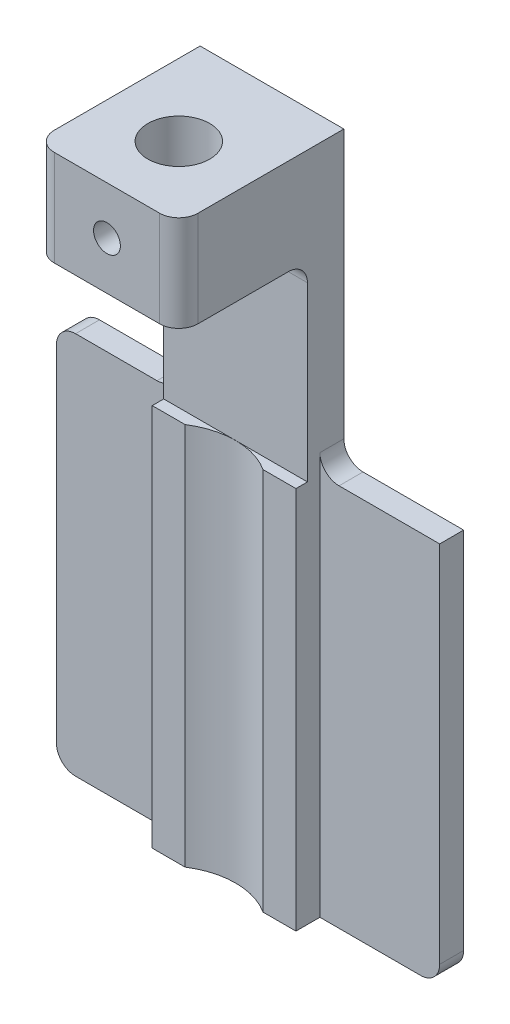
ISO-10303-21;
HEADER;
FILE_DESCRIPTION(('STEP AP214'),'2;1');
FILE_NAME('part.step','',(''),(''),'','','');
FILE_SCHEMA(('AUTOMOTIVE_DESIGN { 1 0 10303 214 1 1 1 1 }'));
ENDSEC;
DATA;
#1=APPLICATION_CONTEXT('core data for automotive mechanical design processes');
#2=APPLICATION_PROTOCOL_DEFINITION('international standard','automotive_design',2000,#1);
#3=PRODUCT_CONTEXT('',#1,'mechanical');
#4=PRODUCT('Part','Part','',(#3));
#5=PRODUCT_RELATED_PRODUCT_CATEGORY('part','',(#4));
#6=PRODUCT_DEFINITION_FORMATION('','',#4);
#7=PRODUCT_DEFINITION_CONTEXT('part definition',#1,'design');
#8=PRODUCT_DEFINITION('design','',#6,#7);
#9=PRODUCT_DEFINITION_SHAPE('','',#8);
#10=(LENGTH_UNIT() NAMED_UNIT(*) SI_UNIT(.MILLI.,.METRE.));
#11=(NAMED_UNIT(*) PLANE_ANGLE_UNIT() SI_UNIT($,.RADIAN.));
#12=(NAMED_UNIT(*) SI_UNIT($,.STERADIAN.) SOLID_ANGLE_UNIT());
#13=UNCERTAINTY_MEASURE_WITH_UNIT(LENGTH_MEASURE(1.E-05),#10,'distance_accuracy_value','');
#14=(GEOMETRIC_REPRESENTATION_CONTEXT(3) GLOBAL_UNCERTAINTY_ASSIGNED_CONTEXT((#13)) GLOBAL_UNIT_ASSIGNED_CONTEXT((#10,
#11,#12)) REPRESENTATION_CONTEXT('',''));
#15=CARTESIAN_POINT('',(0.,0.,0.));
#16=DIRECTION('',(0.,0.,1.));
#17=DIRECTION('',(1.,0.,0.));
#18=AXIS2_PLACEMENT_3D('',#15,#16,#17);
#19=CARTESIAN_POINT('',(4.7625,12.7,-3.));
#20=DIRECTION('',(0.,0.,-1.));
#21=DIRECTION('',(0.,1.,0.));
#22=AXIS2_PLACEMENT_3D('',#19,#20,#21);
#23=PLANE('',#22);
#24=DIRECTION('',(0.,-1.,0.));
#25=VECTOR('',#24,1.);
#26=CARTESIAN_POINT('',(4.7625,12.7,-3.));
#27=LINE('',#26,#25);
#28=CARTESIAN_POINT('',(4.7625,0.,-3.));
#29=VERTEX_POINT('',#28);
#30=CARTESIAN_POINT('',(4.7625,-25.4,-3.));
#31=VERTEX_POINT('',#30);
#32=EDGE_CURVE('E395',#29,#31,#27,.T.);
#33=ORIENTED_EDGE('',*,*,#32,.F.);
#34=DIRECTION('',(1.,0.,0.));
#35=VECTOR('',#34,1.);
#36=CARTESIAN_POINT('',(-8.72906081207247,0.,-3.));
#37=LINE('',#36,#35);
#38=CARTESIAN_POINT('',(2.58406772357072,0.,-3.));
#39=VERTEX_POINT('',#38);
#40=EDGE_CURVE('E220',#39,#29,#37,.T.);
#41=ORIENTED_EDGE('',*,*,#40,.F.);
#42=DIRECTION('',(0.,-1.,0.));
#43=VECTOR('',#42,1.);
#44=CARTESIAN_POINT('',(2.58406772357073,26.1703841816037,-3.));
#45=LINE('',#44,#43);
#46=CARTESIAN_POINT('',(2.58406772357072,-25.4,-3.));
#47=VERTEX_POINT('',#46);
#48=EDGE_CURVE('E387',#39,#47,#45,.T.);
#49=ORIENTED_EDGE('',*,*,#48,.T.);
#50=DIRECTION('',(-1.,0.,0.));
#51=VECTOR('',#50,1.);
#52=CARTESIAN_POINT('',(4.7625,-25.4,-3.));
#53=LINE('',#52,#51);
#54=EDGE_CURVE('E253',#31,#47,#53,.T.);
#55=ORIENTED_EDGE('',*,*,#54,.F.);
#56=EDGE_LOOP('',(#33,#41,#49,#55));
#57=FACE_BOUND('',#56,.T.);
#58=ADVANCED_FACE('F35',(#57),#23,.F.);
#59=CARTESIAN_POINT('',(4.7625,19.05,4.7625));
#60=DIRECTION('',(0.,0.,-1.));
#61=DIRECTION('',(-1.,0.,0.));
#62=AXIS2_PLACEMENT_3D('',#59,#60,#61);
#63=PLANE('',#62);
#64=CARTESIAN_POINT('',(0.,15.875,4.7625));
#65=DIRECTION('',(0.,0.,1.));
#66=DIRECTION('',(1.,0.,0.));
#67=AXIS2_PLACEMENT_3D('',#64,#65,#66);
#68=CIRCLE('',#67,0.889);
#69=CARTESIAN_POINT('',(0.889,15.875,4.7625));
#70=VERTEX_POINT('',#69);
#71=EDGE_CURVE('E476',#70,#70,#68,.T.);
#72=ORIENTED_EDGE('',*,*,#71,.F.);
#73=EDGE_LOOP('',(#72));
#74=FACE_BOUND('',#73,.T.);
#75=DIRECTION('',(-1.,0.,0.));
#76=VECTOR('',#75,1.);
#77=CARTESIAN_POINT('',(4.7625,19.05,4.7625));
#78=LINE('',#77,#76);
#79=CARTESIAN_POINT('',(3.4925,19.05,4.7625));
#80=VERTEX_POINT('',#79);
#81=CARTESIAN_POINT('',(-3.4925,19.05,4.7625));
#82=VERTEX_POINT('',#81);
#83=EDGE_CURVE('E242',#80,#82,#78,.T.);
#84=ORIENTED_EDGE('',*,*,#83,.T.);
#85=DIRECTION('',(0.,-1.,0.));
#86=VECTOR('',#85,1.);
#87=CARTESIAN_POINT('',(-3.4925,19.05,4.7625));
#88=LINE('',#87,#86);
#89=CARTESIAN_POINT('',(-3.4925,12.7,4.7625));
#90=VERTEX_POINT('',#89);
#91=EDGE_CURVE('E267',#82,#90,#88,.T.);
#92=ORIENTED_EDGE('',*,*,#91,.T.);
#93=DIRECTION('',(-1.,0.,0.));
#94=VECTOR('',#93,1.);
#95=CARTESIAN_POINT('',(4.7625,12.7,4.7625));
#96=LINE('',#95,#94);
#97=CARTESIAN_POINT('',(3.4925,12.7,4.7625));
#98=VERTEX_POINT('',#97);
#99=EDGE_CURVE('E256',#98,#90,#96,.T.);
#100=ORIENTED_EDGE('',*,*,#99,.F.);
#101=DIRECTION('',(0.,-1.,0.));
#102=VECTOR('',#101,1.);
#103=CARTESIAN_POINT('',(3.4925,19.05,4.7625));
#104=LINE('',#103,#102);
#105=EDGE_CURVE('E265',#98,#80,#104,.F.);
#106=ORIENTED_EDGE('',*,*,#105,.T.);
#107=EDGE_LOOP('',(#84,#92,#100,#106));
#108=FACE_BOUND('',#107,.T.);
#109=ADVANCED_FACE('F412',(#74,#108),#63,.F.);
#110=CARTESIAN_POINT('',(4.7625,12.7,4.7625));
#111=DIRECTION('',(0.,1.,0.));
#112=DIRECTION('',(0.,0.,1.));
#113=AXIS2_PLACEMENT_3D('',#110,#111,#112);
#114=PLANE('',#113);
#115=ORIENTED_EDGE('',*,*,#99,.T.);
#116=CARTESIAN_POINT('',(-3.4925,12.7,3.4925));
#117=DIRECTION('',(0.,1.,0.));
#118=DIRECTION('',(0.,0.,1.));
#119=AXIS2_PLACEMENT_3D('',#116,#117,#118);
#120=CIRCLE('',#119,1.27);
#121=CARTESIAN_POINT('',(-4.7625,12.7,3.4925));
#122=VERTEX_POINT('',#121);
#123=EDGE_CURVE('E274',#90,#122,#120,.F.);
#124=ORIENTED_EDGE('',*,*,#123,.T.);
#125=DIRECTION('',(0.,0.,-1.));
#126=VECTOR('',#125,1.);
#127=CARTESIAN_POINT('',(-4.7625,12.7,4.7625));
#128=LINE('',#127,#126);
#129=CARTESIAN_POINT('',(-4.7625,12.7,-2.492));
#130=VERTEX_POINT('',#129);
#131=EDGE_CURVE('E228',#122,#130,#128,.T.);
#132=ORIENTED_EDGE('',*,*,#131,.T.);
#133=DIRECTION('',(-1.,0.,0.));
#134=VECTOR('',#133,1.);
#135=CARTESIAN_POINT('',(4.7625,12.7,-2.492));
#136=LINE('',#135,#134);
#137=CARTESIAN_POINT('',(4.7625,12.7,-2.492));
#138=VERTEX_POINT('',#137);
#139=EDGE_CURVE('E270',#130,#138,#136,.F.);
#140=ORIENTED_EDGE('',*,*,#139,.T.);
#141=DIRECTION('',(0.,0.,-1.));
#142=VECTOR('',#141,1.);
#143=CARTESIAN_POINT('',(4.7625,12.7,4.7625));
#144=LINE('',#143,#142);
#145=CARTESIAN_POINT('',(4.7625,12.7,3.4925));
#146=VERTEX_POINT('',#145);
#147=EDGE_CURVE('E241',#146,#138,#144,.T.);
#148=ORIENTED_EDGE('',*,*,#147,.F.);
#149=CARTESIAN_POINT('',(3.4925,12.7,3.4925));
#150=DIRECTION('',(0.,1.,0.));
#151=DIRECTION('',(0.,0.,1.));
#152=AXIS2_PLACEMENT_3D('',#149,#150,#151);
#153=CIRCLE('',#152,1.27);
#154=EDGE_CURVE('E272',#146,#98,#153,.F.);
#155=ORIENTED_EDGE('',*,*,#154,.T.);
#156=EDGE_LOOP('',(#115,#124,#132,#140,#148,#155));
#157=FACE_BOUND('',#156,.T.);
#158=CARTESIAN_POINT('',(0.,12.7,0.));
#159=DIRECTION('',(0.,1.,0.));
#160=DIRECTION('',(0.,0.,1.));
#161=AXIS2_PLACEMENT_3D('',#158,#159,#160);
#162=CIRCLE('',#161,2.05);
#163=CARTESIAN_POINT('',(0.,12.7,2.05000000000001));
#164=VERTEX_POINT('',#163);
#165=EDGE_CURVE('E233',#164,#164,#162,.T.);
#166=ORIENTED_EDGE('',*,*,#165,.T.);
#167=EDGE_LOOP('',(#166));
#168=FACE_BOUND('',#167,.T.);
#169=ADVANCED_FACE('F337',(#157,#168),#114,.F.);
#170=DIRECTION('',(0.,-1.,0.));
#171=VECTOR('',#170,1.);
#172=CARTESIAN_POINT('',(-2.58406772357073,26.1703841816037,-3.));
#173=LINE('',#172,#171);
#174=CARTESIAN_POINT('',(-2.58406772357072,-25.4,-3.));
#175=VERTEX_POINT('',#174);
#176=CARTESIAN_POINT('',(-2.58406772357072,0.,-3.));
#177=VERTEX_POINT('',#176);
#178=EDGE_CURVE('E218',#175,#177,#173,.F.);
#179=ORIENTED_EDGE('',*,*,#178,.T.);
#180=CARTESIAN_POINT('',(-4.7625,0.,-3.));
#181=VERTEX_POINT('',#180);
#182=EDGE_CURVE('E203',#181,#177,#37,.T.);
#183=ORIENTED_EDGE('',*,*,#182,.F.);
#184=DIRECTION('',(0.,-1.,0.));
#185=VECTOR('',#184,1.);
#186=CARTESIAN_POINT('',(-4.7625,12.7,-3.));
#187=LINE('',#186,#185);
#188=CARTESIAN_POINT('',(-4.7625,-25.4,-3.));
#189=VERTEX_POINT('',#188);
#190=EDGE_CURVE('E216',#181,#189,#187,.T.);
#191=ORIENTED_EDGE('',*,*,#190,.T.);
#192=EDGE_CURVE('E252',#175,#189,#53,.T.);
#193=ORIENTED_EDGE('',*,*,#192,.F.);
#194=EDGE_LOOP('',(#179,#183,#191,#193));
#195=FACE_BOUND('',#194,.T.);
#196=ADVANCED_FACE('F214',(#195),#23,.F.);
#197=CARTESIAN_POINT('',(4.7625,-25.4,-3.));
#198=DIRECTION('',(0.,1.,0.));
#199=DIRECTION('',(0.,0.,1.));
#200=AXIS2_PLACEMENT_3D('',#197,#198,#199);
#201=PLANE('',#200);
#202=DIRECTION('',(-1.,0.,0.));
#203=VECTOR('',#202,1.);
#204=CARTESIAN_POINT('',(4.7625,-25.4,-6.175));
#205=LINE('',#204,#203);
#206=CARTESIAN_POINT('',(11.43,-25.4,-6.175));
#207=VERTEX_POINT('',#206);
#208=CARTESIAN_POINT('',(-11.43,-25.4,-6.175));
#209=VERTEX_POINT('',#208);
#210=EDGE_CURVE('E249',#207,#209,#205,.T.);
#211=ORIENTED_EDGE('',*,*,#210,.F.);
#212=DIRECTION('',(0.,0.,-1.));
#213=VECTOR('',#212,1.);
#214=CARTESIAN_POINT('',(11.43,-25.4,-4.5875));
#215=LINE('',#214,#213);
#216=CARTESIAN_POINT('',(11.43,-25.4,-4.5875));
#217=VERTEX_POINT('',#216);
#218=EDGE_CURVE('E302',#207,#217,#215,.F.);
#219=ORIENTED_EDGE('',*,*,#218,.T.);
#220=DIRECTION('',(-1.,0.,0.));
#221=VECTOR('',#220,1.);
#222=CARTESIAN_POINT('',(12.7,-25.4,-4.5875));
#223=LINE('',#222,#221);
#224=CARTESIAN_POINT('',(4.7625,-25.4,-4.5875));
#225=VERTEX_POINT('',#224);
#226=EDGE_CURVE('E368',#217,#225,#223,.T.);
#227=ORIENTED_EDGE('',*,*,#226,.T.);
#228=DIRECTION('',(0.,0.,-1.));
#229=VECTOR('',#228,1.);
#230=CARTESIAN_POINT('',(4.7625,-25.4,-3.));
#231=LINE('',#230,#229);
#232=EDGE_CURVE('E397',#31,#225,#231,.T.);
#233=ORIENTED_EDGE('',*,*,#232,.F.);
#234=ORIENTED_EDGE('',*,*,#54,.T.);
#235=CARTESIAN_POINT('',(0.,-25.4,1.0005));
#236=DIRECTION('',(0.,-1.,0.));
#237=DIRECTION('',(0.,0.,-1.));
#238=AXIS2_PLACEMENT_3D('',#235,#236,#237);
#239=CIRCLE('',#238,4.7625);
#240=EDGE_CURVE('E383',#175,#47,#239,.T.);
#241=ORIENTED_EDGE('',*,*,#240,.F.);
#242=ORIENTED_EDGE('',*,*,#192,.T.);
#243=DIRECTION('',(0.,0.,-1.));
#244=VECTOR('',#243,1.);
#245=CARTESIAN_POINT('',(-4.7625,-25.4,-3.));
#246=LINE('',#245,#244);
#247=CARTESIAN_POINT('',(-4.7625,-25.4,-4.5875));
#248=VERTEX_POINT('',#247);
#249=EDGE_CURVE('E227',#189,#248,#246,.T.);
#250=ORIENTED_EDGE('',*,*,#249,.T.);
#251=CARTESIAN_POINT('',(-11.43,-25.4,-4.5875));
#252=VERTEX_POINT('',#251);
#253=EDGE_CURVE('E367',#248,#252,#223,.T.);
#254=ORIENTED_EDGE('',*,*,#253,.T.);
#255=DIRECTION('',(0.,0.,-1.));
#256=VECTOR('',#255,1.);
#257=CARTESIAN_POINT('',(-11.43,-25.4,-6.175));
#258=LINE('',#257,#256);
#259=EDGE_CURVE('E299',#252,#209,#258,.T.);
#260=ORIENTED_EDGE('',*,*,#259,.T.);
#261=EDGE_LOOP('',(#211,#219,#227,#233,#234,#241,#242,#250,#254,#260));
#262=FACE_BOUND('',#261,.T.);
#263=ADVANCED_FACE('F447',(#262),#201,.F.);
#264=CARTESIAN_POINT('',(4.7625,-25.4,-6.175));
#265=DIRECTION('',(0.,0.,1.));
#266=DIRECTION('',(0.,-1.,0.));
#267=AXIS2_PLACEMENT_3D('',#264,#265,#266);
#268=PLANE('',#267);
#269=DIRECTION('',(0.,-1.,0.));
#270=VECTOR('',#269,1.);
#271=CARTESIAN_POINT('',(12.7,0.,-6.175));
#272=LINE('',#271,#270);
#273=CARTESIAN_POINT('',(12.7,0.,-6.175));
#274=VERTEX_POINT('',#273);
#275=CARTESIAN_POINT('',(12.7,-24.13,-6.175));
#276=VERTEX_POINT('',#275);
#277=EDGE_CURVE('E361',#274,#276,#272,.T.);
#278=ORIENTED_EDGE('',*,*,#277,.T.);
#279=CARTESIAN_POINT('',(11.43,-24.13,-6.175));
#280=DIRECTION('',(0.,0.,1.));
#281=DIRECTION('',(0.,-1.,0.));
#282=AXIS2_PLACEMENT_3D('',#279,#280,#281);
#283=CIRCLE('',#282,1.27);
#284=EDGE_CURVE('E297',#276,#207,#283,.F.);
#285=ORIENTED_EDGE('',*,*,#284,.T.);
#286=ORIENTED_EDGE('',*,*,#210,.T.);
#287=CARTESIAN_POINT('',(-11.43,-24.13,-6.175));
#288=DIRECTION('',(0.,0.,1.));
#289=DIRECTION('',(0.,-1.,0.));
#290=AXIS2_PLACEMENT_3D('',#287,#288,#289);
#291=CIRCLE('',#290,1.27);
#292=CARTESIAN_POINT('',(-12.7,-24.13,-6.175));
#293=VERTEX_POINT('',#292);
#294=EDGE_CURVE('E295',#209,#293,#291,.F.);
#295=ORIENTED_EDGE('',*,*,#294,.T.);
#296=DIRECTION('',(0.,1.,0.));
#297=VECTOR('',#296,1.);
#298=CARTESIAN_POINT('',(-12.7,0.,-6.175));
#299=LINE('',#298,#297);
#300=CARTESIAN_POINT('',(-12.7,-1.27,-6.175));
#301=VERTEX_POINT('',#300);
#302=EDGE_CURVE('E356',#293,#301,#299,.T.);
#303=ORIENTED_EDGE('',*,*,#302,.T.);
#304=CARTESIAN_POINT('',(-11.43,-1.27,-6.175));
#305=DIRECTION('',(0.,0.,1.));
#306=DIRECTION('',(0.,-1.,0.));
#307=AXIS2_PLACEMENT_3D('',#304,#305,#306);
#308=CIRCLE('',#307,1.27);
#309=CARTESIAN_POINT('',(-11.43,0.,-6.175));
#310=VERTEX_POINT('',#309);
#311=EDGE_CURVE('E293',#301,#310,#308,.F.);
#312=ORIENTED_EDGE('',*,*,#311,.T.);
#313=DIRECTION('',(1.,0.,0.));
#314=VECTOR('',#313,1.);
#315=CARTESIAN_POINT('',(12.7,0.,-6.175));
#316=LINE('',#315,#314);
#317=CARTESIAN_POINT('',(-6.0325,0.,-6.175));
#318=VERTEX_POINT('',#317);
#319=EDGE_CURVE('E374',#310,#318,#316,.T.);
#320=ORIENTED_EDGE('',*,*,#319,.T.);
#321=CARTESIAN_POINT('',(-6.0325,1.27,-6.175));
#322=DIRECTION('',(0.,0.,1.));
#323=DIRECTION('',(0.,-1.,0.));
#324=AXIS2_PLACEMENT_3D('',#321,#322,#323);
#325=CIRCLE('',#324,1.27);
#326=CARTESIAN_POINT('',(-4.7625,1.27,-6.175));
#327=VERTEX_POINT('',#326);
#328=EDGE_CURVE('E325',#318,#327,#325,.T.);
#329=ORIENTED_EDGE('',*,*,#328,.T.);
#330=DIRECTION('',(0.,1.,0.));
#331=VECTOR('',#330,1.);
#332=CARTESIAN_POINT('',(-4.7625,-25.4,-6.175));
#333=LINE('',#332,#331);
#334=CARTESIAN_POINT('',(-4.7625,19.05,-6.175));
#335=VERTEX_POINT('',#334);
#336=EDGE_CURVE('E230',#327,#335,#333,.T.);
#337=ORIENTED_EDGE('',*,*,#336,.T.);
#338=DIRECTION('',(-1.,0.,0.));
#339=VECTOR('',#338,1.);
#340=CARTESIAN_POINT('',(4.7625,19.05,-6.175));
#341=LINE('',#340,#339);
#342=CARTESIAN_POINT('',(4.7625,19.05,-6.175));
#343=VERTEX_POINT('',#342);
#344=EDGE_CURVE('E245',#343,#335,#341,.T.);
#345=ORIENTED_EDGE('',*,*,#344,.F.);
#346=DIRECTION('',(0.,1.,0.));
#347=VECTOR('',#346,1.);
#348=CARTESIAN_POINT('',(4.7625,-25.4,-6.175));
#349=LINE('',#348,#347);
#350=CARTESIAN_POINT('',(4.7625,1.27,-6.175));
#351=VERTEX_POINT('',#350);
#352=EDGE_CURVE('E400',#351,#343,#349,.T.);
#353=ORIENTED_EDGE('',*,*,#352,.F.);
#354=CARTESIAN_POINT('',(6.0325,1.27,-6.175));
#355=DIRECTION('',(0.,0.,1.));
#356=DIRECTION('',(0.,-1.,0.));
#357=AXIS2_PLACEMENT_3D('',#354,#355,#356);
#358=CIRCLE('',#357,1.27);
#359=CARTESIAN_POINT('',(6.0325,0.,-6.175));
#360=VERTEX_POINT('',#359);
#361=EDGE_CURVE('E330',#351,#360,#358,.T.);
#362=ORIENTED_EDGE('',*,*,#361,.T.);
#363=EDGE_CURVE('E373',#360,#274,#316,.T.);
#364=ORIENTED_EDGE('',*,*,#363,.T.);
#365=EDGE_LOOP('',(#278,#285,#286,#295,#303,#312,#320,#329,#337,#345,#353,#362,#364));
#366=FACE_BOUND('',#365,.T.);
#367=ADVANCED_FACE('F422',(#366),#268,.F.);
#368=CARTESIAN_POINT('',(4.7625,19.05,-6.175));
#369=DIRECTION('',(0.,-1.,0.));
#370=DIRECTION('',(0.,0.,-1.));
#371=AXIS2_PLACEMENT_3D('',#368,#369,#370);
#372=PLANE('',#371);
#373=CARTESIAN_POINT('',(0.,19.05,0.));
#374=DIRECTION('',(0.,1.,0.));
#375=DIRECTION('',(0.,0.,1.));
#376=AXIS2_PLACEMENT_3D('',#373,#374,#375);
#377=CIRCLE('',#376,2.05);
#378=CARTESIAN_POINT('',(0.,19.05,2.05000000000001));
#379=VERTEX_POINT('',#378);
#380=EDGE_CURVE('E389',#379,#379,#377,.T.);
#381=ORIENTED_EDGE('',*,*,#380,.F.);
#382=EDGE_LOOP('',(#381));
#383=FACE_BOUND('',#382,.T.);
#384=DIRECTION('',(0.,0.,1.));
#385=VECTOR('',#384,1.);
#386=CARTESIAN_POINT('',(-4.7625,19.05,-6.175));
#387=LINE('',#386,#385);
#388=CARTESIAN_POINT('',(-4.7625,19.05,3.4925));
#389=VERTEX_POINT('',#388);
#390=EDGE_CURVE('E238',#335,#389,#387,.T.);
#391=ORIENTED_EDGE('',*,*,#390,.T.);
#392=CARTESIAN_POINT('',(-3.4925,19.05,3.4925));
#393=DIRECTION('',(0.,-1.,0.));
#394=DIRECTION('',(0.,0.,-1.));
#395=AXIS2_PLACEMENT_3D('',#392,#393,#394);
#396=CIRCLE('',#395,1.27);
#397=EDGE_CURVE('E283',#389,#82,#396,.F.);
#398=ORIENTED_EDGE('',*,*,#397,.T.);
#399=ORIENTED_EDGE('',*,*,#83,.F.);
#400=CARTESIAN_POINT('',(3.4925,19.05,3.4925));
#401=DIRECTION('',(0.,-1.,0.));
#402=DIRECTION('',(0.,0.,-1.));
#403=AXIS2_PLACEMENT_3D('',#400,#401,#402);
#404=CIRCLE('',#403,1.27);
#405=CARTESIAN_POINT('',(4.7625,19.05,3.4925));
#406=VERTEX_POINT('',#405);
#407=EDGE_CURVE('E281',#80,#406,#404,.F.);
#408=ORIENTED_EDGE('',*,*,#407,.T.);
#409=DIRECTION('',(0.,0.,1.));
#410=VECTOR('',#409,1.);
#411=CARTESIAN_POINT('',(4.7625,19.05,-6.175));
#412=LINE('',#411,#410);
#413=EDGE_CURVE('E246',#343,#406,#412,.T.);
#414=ORIENTED_EDGE('',*,*,#413,.F.);
#415=ORIENTED_EDGE('',*,*,#344,.T.);
#416=EDGE_LOOP('',(#391,#398,#399,#408,#414,#415));
#417=FACE_BOUND('',#416,.T.);
#418=ADVANCED_FACE('F420',(#383,#417),#372,.F.);
#419=CARTESIAN_POINT('',(4.7625,0.,0.));
#420=DIRECTION('',(1.,0.,0.));
#421=DIRECTION('',(0.,0.,-1.));
#422=AXIS2_PLACEMENT_3D('',#419,#420,#421);
#423=PLANE('',#422);
#424=ORIENTED_EDGE('',*,*,#413,.T.);
#425=DIRECTION('',(0.,-1.,0.));
#426=VECTOR('',#425,1.);
#427=CARTESIAN_POINT('',(4.7625,12.7,3.4925));
#428=LINE('',#427,#426);
#429=EDGE_CURVE('E287',#406,#146,#428,.T.);
#430=ORIENTED_EDGE('',*,*,#429,.T.);
#431=ORIENTED_EDGE('',*,*,#147,.T.);
#432=CARTESIAN_POINT('',(4.7625,11.43,-2.492));
#433=DIRECTION('',(1.,0.,0.));
#434=DIRECTION('',(0.,0.,-1.));
#435=AXIS2_PLACEMENT_3D('',#432,#433,#434);
#436=CIRCLE('',#435,1.27);
#437=CARTESIAN_POINT('',(4.7625,11.43,-3.762));
#438=VERTEX_POINT('',#437);
#439=EDGE_CURVE('E11',#138,#438,#436,.F.);
#440=ORIENTED_EDGE('',*,*,#439,.T.);
#441=DIRECTION('',(0.,-1.,0.));
#442=VECTOR('',#441,1.);
#443=CARTESIAN_POINT('',(4.7625,0.,-3.762));
#444=LINE('',#443,#442);
#445=CARTESIAN_POINT('',(4.7625,0.,-3.762));
#446=VERTEX_POINT('',#445);
#447=EDGE_CURVE('E210',#438,#446,#444,.T.);
#448=ORIENTED_EDGE('',*,*,#447,.T.);
#449=DIRECTION('',(0.,0.,-1.));
#450=VECTOR('',#449,1.);
#451=CARTESIAN_POINT('',(4.7625,0.,0.));
#452=LINE('',#451,#450);
#453=EDGE_CURVE('E209',#29,#446,#452,.T.);
#454=ORIENTED_EDGE('',*,*,#453,.F.);
#455=ORIENTED_EDGE('',*,*,#32,.T.);
#456=ORIENTED_EDGE('',*,*,#232,.T.);
#457=DIRECTION('',(0.,1.,0.));
#458=VECTOR('',#457,1.);
#459=CARTESIAN_POINT('',(4.7625,0.,-4.5875));
#460=LINE('',#459,#458);
#461=CARTESIAN_POINT('',(4.7625,1.27,-4.5875));
#462=VERTEX_POINT('',#461);
#463=EDGE_CURVE('E381',#225,#462,#460,.T.);
#464=ORIENTED_EDGE('',*,*,#463,.T.);
#465=DIRECTION('',(0.,0.,1.));
#466=VECTOR('',#465,1.);
#467=CARTESIAN_POINT('',(4.7625,1.27,-6.175));
#468=LINE('',#467,#466);
#469=EDGE_CURVE('E285',#462,#351,#468,.F.);
#470=ORIENTED_EDGE('',*,*,#469,.T.);
#471=ORIENTED_EDGE('',*,*,#352,.T.);
#472=EDGE_LOOP('',(#424,#430,#431,#440,#448,#454,#455,#456,#464,#470,#471));
#473=FACE_BOUND('',#472,.T.);
#474=ADVANCED_FACE('F345',(#473),#423,.T.);
#475=CARTESIAN_POINT('',(-4.7625,0.,0.));
#476=DIRECTION('',(1.,0.,0.));
#477=DIRECTION('',(0.,0.,-1.));
#478=AXIS2_PLACEMENT_3D('',#475,#476,#477);
#479=PLANE('',#478);
#480=ORIENTED_EDGE('',*,*,#131,.F.);
#481=DIRECTION('',(0.,-1.,0.));
#482=VECTOR('',#481,1.);
#483=CARTESIAN_POINT('',(-4.7625,0.,3.4925));
#484=LINE('',#483,#482);
#485=EDGE_CURVE('E279',#122,#389,#484,.F.);
#486=ORIENTED_EDGE('',*,*,#485,.T.);
#487=ORIENTED_EDGE('',*,*,#390,.F.);
#488=ORIENTED_EDGE('',*,*,#336,.F.);
#489=DIRECTION('',(0.,0.,1.));
#490=VECTOR('',#489,1.);
#491=CARTESIAN_POINT('',(-4.7625,1.27,0.));
#492=LINE('',#491,#490);
#493=CARTESIAN_POINT('',(-4.7625,1.27,-4.5875));
#494=VERTEX_POINT('',#493);
#495=EDGE_CURVE('E276',#327,#494,#492,.T.);
#496=ORIENTED_EDGE('',*,*,#495,.T.);
#497=DIRECTION('',(0.,1.,0.));
#498=VECTOR('',#497,1.);
#499=CARTESIAN_POINT('',(-4.7625,0.,-4.5875));
#500=LINE('',#499,#498);
#501=EDGE_CURVE('E259',#248,#494,#500,.T.);
#502=ORIENTED_EDGE('',*,*,#501,.F.);
#503=ORIENTED_EDGE('',*,*,#249,.F.);
#504=ORIENTED_EDGE('',*,*,#190,.F.);
#505=DIRECTION('',(0.,0.,-1.));
#506=VECTOR('',#505,1.);
#507=CARTESIAN_POINT('',(-4.7625,0.,0.));
#508=LINE('',#507,#506);
#509=CARTESIAN_POINT('',(-4.7625,0.,-3.762));
#510=VERTEX_POINT('',#509);
#511=EDGE_CURVE('E199',#181,#510,#508,.T.);
#512=ORIENTED_EDGE('',*,*,#511,.T.);
#513=DIRECTION('',(0.,-1.,0.));
#514=VECTOR('',#513,1.);
#515=CARTESIAN_POINT('',(-4.7625,0.,-3.762));
#516=LINE('',#515,#514);
#517=CARTESIAN_POINT('',(-4.7625,11.43,-3.762));
#518=VERTEX_POINT('',#517);
#519=EDGE_CURVE('E332',#518,#510,#516,.T.);
#520=ORIENTED_EDGE('',*,*,#519,.F.);
#521=CARTESIAN_POINT('',(-4.7625,11.43,-2.492));
#522=DIRECTION('',(1.,0.,0.));
#523=DIRECTION('',(0.,0.,-1.));
#524=AXIS2_PLACEMENT_3D('',#521,#522,#523);
#525=CIRCLE('',#524,1.27);
#526=EDGE_CURVE('E43',#518,#130,#525,.T.);
#527=ORIENTED_EDGE('',*,*,#526,.T.);
#528=EDGE_LOOP('',(#480,#486,#487,#488,#496,#502,#503,#504,#512,#520,#527));
#529=FACE_BOUND('',#528,.T.);
#530=ADVANCED_FACE('F224',(#529),#479,.F.);
#531=CARTESIAN_POINT('',(0.,-25.4,0.));
#532=DIRECTION('',(0.,1.,0.));
#533=DIRECTION('',(0.,0.,1.));
#534=AXIS2_PLACEMENT_3D('',#531,#532,#533);
#535=CYLINDRICAL_SURFACE('',#534,2.05);
#536=CARTESIAN_POINT('',(0.,14.986,2.05000000000001));
#537=CARTESIAN_POINT('',(0.0474528579151308,14.9860055581248,2.04999575765803));
#538=CARTESIAN_POINT('',(0.0949713440315668,14.9898216080301,2.04833360545341));
#539=CARTESIAN_POINT('',(0.188653906627282,15.0049459962746,2.04184448077722));
#540=CARTESIAN_POINT('',(0.234814316061639,15.0162729664963,2.03700963831669));
#541=CARTESIAN_POINT('',(0.324269060647118,15.0459148960365,2.02469269024092));
#542=CARTESIAN_POINT('',(0.367572809792734,15.0642054025419,2.01721985468098));
#543=CARTESIAN_POINT('',(0.450452284592629,15.1071499433453,2.00034594361552));
#544=CARTESIAN_POINT('',(0.490028965438168,15.1318023410956,1.99094536413485));
#545=CARTESIAN_POINT('',(0.566512613056321,15.1881595389857,1.97058508486758));
#546=CARTESIAN_POINT('',(0.603194499236868,15.2201501783119,1.95957163309072));
#547=CARTESIAN_POINT('',(0.670869065538074,15.2896699819693,1.93744800192781));
#548=CARTESIAN_POINT('',(0.701858514336399,15.3272022703583,1.92633777132981));
#549=CARTESIAN_POINT('',(0.758937059735904,15.4092065253434,1.90459932665587));
#550=CARTESIAN_POINT('',(0.784668552572962,15.4539447022644,1.89403007360531));
#551=CARTESIAN_POINT('',(0.828140644448848,15.5476366328233,1.87543228720345));
#552=CARTESIAN_POINT('',(0.845885694590283,15.5965880201347,1.86740233935929));
#553=CARTESIAN_POINT('',(0.871932352870103,15.6947265810569,1.85537907506483));
#554=CARTESIAN_POINT('',(0.88066890746617,15.7437747589585,1.85120099305471));
#555=CARTESIAN_POINT('',(0.889804994445075,15.8428050254113,1.84682850373961));
#556=CARTESIAN_POINT('',(0.890209695076258,15.8927865157669,1.84663162689473));
#557=CARTESIAN_POINT('',(0.882996202948456,15.9877579771325,1.85008876839572));
#558=CARTESIAN_POINT('',(0.876051889086123,16.0328133565815,1.85341935141623));
#559=CARTESIAN_POINT('',(0.855474941955683,16.1210416096403,1.86300565636718));
#560=CARTESIAN_POINT('',(0.841840897389705,16.1642140839297,1.86926199551619));
#561=CARTESIAN_POINT('',(0.808002080748532,16.2485854205944,1.88413889005881));
#562=CARTESIAN_POINT('',(0.787659108474828,16.2897198102669,1.89280851517927));
#563=CARTESIAN_POINT('',(0.741078554124529,16.3681596753751,1.911526007189));
#564=CARTESIAN_POINT('',(0.714838546645616,16.4054635661343,1.92157444050669));
#565=CARTESIAN_POINT('',(0.654370128383688,16.4788067069646,1.943043943893));
#566=CARTESIAN_POINT('',(0.619628028823216,16.5144116731934,1.95450611731549));
#567=CARTESIAN_POINT('',(0.544562499707731,16.5794426394211,1.97673546939088));
#568=CARTESIAN_POINT('',(0.504237543572235,16.6088669438167,1.98750245676675));
#569=CARTESIAN_POINT('',(0.417737352200935,16.6614119759061,2.00748984824284));
#570=CARTESIAN_POINT('',(0.371433964665871,16.6843419327861,2.01666088163634));
#571=CARTESIAN_POINT('',(0.275127220176955,16.7219317882383,2.0320375070119));
#572=CARTESIAN_POINT('',(0.225126102816604,16.7365966470489,2.03824487727213));
#573=CARTESIAN_POINT('',(0.126460198688836,16.7562984365366,2.04665399593108));
#574=CARTESIAN_POINT('',(0.0779322307302638,16.7619173085692,2.04909737469206));
#575=CARTESIAN_POINT('',(-0.01943141454637,16.7651200167866,2.05048524506923));
#576=CARTESIAN_POINT('',(-0.0682669889867908,16.7627064103607,2.04943085031074));
#577=CARTESIAN_POINT('',(-0.162040612099163,16.7503163450305,2.04409634987832));
#578=CARTESIAN_POINT('',(-0.207045715447586,16.740760901719,2.03999589061292));
#579=CARTESIAN_POINT('',(-0.294757025220947,16.7149583042726,2.02918019429298));
#580=CARTESIAN_POINT('',(-0.33746294689558,16.6987103234225,2.02246463420608));
#581=CARTESIAN_POINT('',(-0.420875512743055,16.6594590831903,2.00679392937472));
#582=CARTESIAN_POINT('',(-0.461477976790395,16.6362605913483,1.99777535666972));
#583=CARTESIAN_POINT('',(-0.538360299131923,16.5839800092708,1.9784443837636));
#584=CARTESIAN_POINT('',(-0.574638287393717,16.5548953882579,1.96813142776134));
#585=CARTESIAN_POINT('',(-0.644785530164377,16.4890529200015,1.94633060686886));
#586=CARTESIAN_POINT('',(-0.678253794833684,16.4518765073341,1.93481344150998));
#587=CARTESIAN_POINT('',(-0.738602407859668,16.3722754843584,1.91259068391679));
#588=CARTESIAN_POINT('',(-0.765480769884096,16.3298492974441,1.90188533705122));
#589=CARTESIAN_POINT('',(-0.812320986562724,16.2398009440294,1.88236385740623));
#590=CARTESIAN_POINT('',(-0.832136584511407,16.1920930719584,1.8735889722761));
#591=CARTESIAN_POINT('',(-0.863271553861798,16.0935142973635,1.8594515089125));
#592=CARTESIAN_POINT('',(-0.874598722203254,16.0426463441254,1.85408579991453));
#593=CARTESIAN_POINT('',(-0.887631035630673,15.9436759654801,1.84787945293842));
#594=CARTESIAN_POINT('',(-0.890047845549476,15.8956879587354,1.84670439081589));
#595=CARTESIAN_POINT('',(-0.887122752558366,15.8000104234967,1.84811152680251));
#596=CARTESIAN_POINT('',(-0.881782302977103,15.7523208407738,1.85069302111803));
#597=CARTESIAN_POINT('',(-0.864107902343631,15.661289733508,1.85900617365623));
#598=CARTESIAN_POINT('',(-0.852171566923932,15.6178529582325,1.86455820515646));
#599=CARTESIAN_POINT('',(-0.822051394923592,15.5335975661412,1.87803146960602));
#600=CARTESIAN_POINT('',(-0.803865772912931,15.4927797015112,1.88595337954916));
#601=CARTESIAN_POINT('',(-0.760455407929364,15.4121220514374,1.90388844478561));
#602=CARTESIAN_POINT('',(-0.734860856723541,15.3725039921958,1.9140015659098));
#603=CARTESIAN_POINT('',(-0.677854094739963,15.297903275715,1.93492509815253));
#604=CARTESIAN_POINT('',(-0.646439608741919,15.2629224405392,1.94573578089191));
#605=CARTESIAN_POINT('',(-0.575649206260749,15.195645245939,1.96789514817893));
#606=CARTESIAN_POINT('',(-0.535832823976499,15.1638008271235,1.9792157551499));
#607=CARTESIAN_POINT('',(-0.451014748984267,15.1072076697115,2.00024801103087));
#608=CARTESIAN_POINT('',(-0.406010716895256,15.0824621500643,2.0099589291981));
#609=CARTESIAN_POINT('',(-0.312623761075306,15.04123869263,2.02656988816032));
#610=CARTESIAN_POINT('',(-0.264295167301355,15.0246528050894,2.03350639012226));
#611=CARTESIAN_POINT('',(-0.16525000715742,15.0000138867921,2.04393043351911));
#612=CARTESIAN_POINT('',(-0.114541313213179,14.9919345470314,2.04742860675385));
#613=CARTESIAN_POINT('',(-0.0423966629903596,14.9867559334456,2.04967273052365));
#614=CARTESIAN_POINT('',(-0.0212048840031968,14.9859975162847,2.05000189574187));
#615=CARTESIAN_POINT('',(0.,14.986,2.05000000000001));
#616=B_SPLINE_CURVE_WITH_KNOTS('',3,(#536,#537,#538,#539,#540,#541,#542,#543,#544,#545,#546,
#547,#548,#549,#550,#551,#552,#553,#554,#555,#556,#557,#558,#559,#560,#561,#562,#563,#564,#565,
#566,#567,#568,#569,#570,#571,#572,#573,#574,#575,#576,#577,#578,#579,#580,#581,#582,#583,#584,
#585,#586,#587,#588,#589,#590,#591,#592,#593,#594,#595,#596,#597,#598,#599,#600,#601,#602,#603,
#604,#605,#606,#607,#608,#609,#610,#611,#612,#613,#614,#615),.UNSPECIFIED.,.T.,.F.,(4,2,2,2,2,2,
2,2,2,2,2,2,2,2,2,2,2,2,2,2,2,2,2,2,2,2,2,2,2,2,2,2,2,2,2,2,2,2,2,4),(0.,0.142294621983022,
0.284943552705918,0.42709611688782,0.569212149802014,0.718275384037985,0.867422974550202,
1.02467185140163,1.18183297951426,1.3309894752227,1.48005344637928,1.61654336087012,
1.75306208232044,1.8925897738001,2.03217495724453,2.18463965422308,2.33714612390717,
2.49375333287231,2.65026645480444,2.79623799817979,2.94216307142127,3.08010406998256,
3.21806211322062,3.36033127739839,3.50266174152998,3.6559592177324,3.80930284429724,
3.96565907679512,4.12187151361923,4.26529820952765,4.40869803779776,4.54427107980185,
4.67988288746324,4.82399608225221,4.96816573537628,5.12409903783269,5.28010293586364,
5.43398338194312,5.58738649674725,5.65097257113765),.UNSPECIFIED.);
#617=CARTESIAN_POINT('',(0.,14.986,2.05000000000001));
#618=VERTEX_POINT('',#617);
#619=EDGE_CURVE('E474',#618,#618,#616,.T.);
#620=ORIENTED_EDGE('',*,*,#619,.T.);
#621=EDGE_LOOP('',(#620));
#622=FACE_BOUND('',#621,.T.);
#623=ORIENTED_EDGE('',*,*,#380,.T.);
#624=EDGE_LOOP('',(#623));
#625=FACE_BOUND('',#624,.T.);
#626=ORIENTED_EDGE('',*,*,#165,.F.);
#627=EDGE_LOOP('',(#626));
#628=FACE_BOUND('',#627,.T.);
#629=ADVANCED_FACE('F633',(#622,#625,#628),#535,.F.);
#630=CARTESIAN_POINT('',(0.,26.1703841816037,1.0005));
#631=DIRECTION('',(0.,-1.,0.));
#632=DIRECTION('',(0.,0.,-1.));
#633=AXIS2_PLACEMENT_3D('',#630,#631,#632);
#634=CYLINDRICAL_SURFACE('',#633,4.7625);
#635=CARTESIAN_POINT('',(0.,0.,1.0005));
#636=DIRECTION('',(0.,-1.,0.));
#637=DIRECTION('',(0.,0.,-1.));
#638=AXIS2_PLACEMENT_3D('',#635,#636,#637);
#639=CIRCLE('',#638,4.7625);
#640=CARTESIAN_POINT('',(0.,0.,-3.762));
#641=VERTEX_POINT('',#640);
#642=EDGE_CURVE('E261',#39,#641,#639,.F.);
#643=ORIENTED_EDGE('',*,*,#642,.T.);
#644=EDGE_CURVE('E264',#641,#177,#639,.F.);
#645=ORIENTED_EDGE('',*,*,#644,.T.);
#646=ORIENTED_EDGE('',*,*,#178,.F.);
#647=ORIENTED_EDGE('',*,*,#240,.T.);
#648=ORIENTED_EDGE('',*,*,#48,.F.);
#649=EDGE_LOOP('',(#643,#645,#646,#647,#648));
#650=FACE_BOUND('',#649,.T.);
#651=ADVANCED_FACE('F471',(#650),#634,.F.);
#652=CARTESIAN_POINT('',(-12.7,0.,-4.5875));
#653=DIRECTION('',(-1.,0.,0.));
#654=DIRECTION('',(0.,-1.,0.));
#655=AXIS2_PLACEMENT_3D('',#652,#653,#654);
#656=PLANE('',#655);
#657=ORIENTED_EDGE('',*,*,#302,.F.);
#658=DIRECTION('',(0.,0.,-1.));
#659=VECTOR('',#658,1.);
#660=CARTESIAN_POINT('',(-12.7,-24.13,-4.5875));
#661=LINE('',#660,#659);
#662=CARTESIAN_POINT('',(-12.7,-24.13,-4.5875));
#663=VERTEX_POINT('',#662);
#664=EDGE_CURVE('E309',#293,#663,#661,.F.);
#665=ORIENTED_EDGE('',*,*,#664,.T.);
#666=DIRECTION('',(0.,1.,0.));
#667=VECTOR('',#666,1.);
#668=CARTESIAN_POINT('',(-12.7,0.,-4.5875));
#669=LINE('',#668,#667);
#670=CARTESIAN_POINT('',(-12.7,-1.27,-4.5875));
#671=VERTEX_POINT('',#670);
#672=EDGE_CURVE('E357',#663,#671,#669,.T.);
#673=ORIENTED_EDGE('',*,*,#672,.T.);
#674=DIRECTION('',(0.,0.,-1.));
#675=VECTOR('',#674,1.);
#676=CARTESIAN_POINT('',(-12.7,-1.27,-4.5875));
#677=LINE('',#676,#675);
#678=EDGE_CURVE('E306',#671,#301,#677,.T.);
#679=ORIENTED_EDGE('',*,*,#678,.T.);
#680=EDGE_LOOP('',(#657,#665,#673,#679));
#681=FACE_BOUND('',#680,.T.);
#682=ADVANCED_FACE('F436',(#681),#656,.T.);
#683=CARTESIAN_POINT('',(0.,0.,-4.5875));
#684=DIRECTION('',(0.,0.,-1.));
#685=DIRECTION('',(-1.,0.,0.));
#686=AXIS2_PLACEMENT_3D('',#683,#684,#685);
#687=PLANE('',#686);
#688=ORIENTED_EDGE('',*,*,#672,.F.);
#689=CARTESIAN_POINT('',(-11.43,-24.13,-4.5875));
#690=DIRECTION('',(0.,0.,-1.));
#691=DIRECTION('',(-1.,0.,0.));
#692=AXIS2_PLACEMENT_3D('',#689,#690,#691);
#693=CIRCLE('',#692,1.27);
#694=EDGE_CURVE('E313',#663,#252,#693,.F.);
#695=ORIENTED_EDGE('',*,*,#694,.T.);
#696=ORIENTED_EDGE('',*,*,#253,.F.);
#697=ORIENTED_EDGE('',*,*,#501,.T.);
#698=CARTESIAN_POINT('',(-6.0325,1.27,-4.5875));
#699=DIRECTION('',(0.,0.,-1.));
#700=DIRECTION('',(-1.,0.,0.));
#701=AXIS2_PLACEMENT_3D('',#698,#699,#700);
#702=CIRCLE('',#701,1.27);
#703=CARTESIAN_POINT('',(-6.0325,0.,-4.5875));
#704=VERTEX_POINT('',#703);
#705=EDGE_CURVE('E50',#494,#704,#702,.T.);
#706=ORIENTED_EDGE('',*,*,#705,.T.);
#707=DIRECTION('',(1.,0.,0.));
#708=VECTOR('',#707,1.);
#709=CARTESIAN_POINT('',(12.7,0.,-4.5875));
#710=LINE('',#709,#708);
#711=CARTESIAN_POINT('',(-11.43,0.,-4.5875));
#712=VERTEX_POINT('',#711);
#713=EDGE_CURVE('E362',#712,#704,#710,.T.);
#714=ORIENTED_EDGE('',*,*,#713,.F.);
#715=CARTESIAN_POINT('',(-11.43,-1.27,-4.5875));
#716=DIRECTION('',(0.,0.,-1.));
#717=DIRECTION('',(-1.,0.,0.));
#718=AXIS2_PLACEMENT_3D('',#715,#716,#717);
#719=CIRCLE('',#718,1.27);
#720=EDGE_CURVE('E311',#712,#671,#719,.F.);
#721=ORIENTED_EDGE('',*,*,#720,.T.);
#722=EDGE_LOOP('',(#688,#695,#696,#697,#706,#714,#721));
#723=FACE_BOUND('',#722,.T.);
#724=ADVANCED_FACE('F440',(#723),#687,.F.);
#725=CARTESIAN_POINT('',(12.7,0.,-4.5875));
#726=DIRECTION('',(0.,1.,0.));
#727=DIRECTION('',(0.,0.,1.));
#728=AXIS2_PLACEMENT_3D('',#725,#726,#727);
#729=PLANE('',#728);
#730=ORIENTED_EDGE('',*,*,#319,.F.);
#731=DIRECTION('',(0.,0.,-1.));
#732=VECTOR('',#731,1.);
#733=CARTESIAN_POINT('',(-11.43,0.,-4.5875));
#734=LINE('',#733,#732);
#735=EDGE_CURVE('E57',#310,#712,#734,.F.);
#736=ORIENTED_EDGE('',*,*,#735,.T.);
#737=ORIENTED_EDGE('',*,*,#713,.T.);
#738=DIRECTION('',(0.,0.,1.));
#739=VECTOR('',#738,1.);
#740=CARTESIAN_POINT('',(-6.0325,0.,-4.5875));
#741=LINE('',#740,#739);
#742=EDGE_CURVE('E315',#704,#318,#741,.F.);
#743=ORIENTED_EDGE('',*,*,#742,.T.);
#744=EDGE_LOOP('',(#730,#736,#737,#743));
#745=FACE_BOUND('',#744,.T.);
#746=ADVANCED_FACE('F429',(#745),#729,.T.);
#747=CARTESIAN_POINT('',(12.7,0.,-4.5875));
#748=DIRECTION('',(1.,0.,0.));
#749=DIRECTION('',(0.,1.,0.));
#750=AXIS2_PLACEMENT_3D('',#747,#748,#749);
#751=PLANE('',#750);
#752=DIRECTION('',(0.,-1.,0.));
#753=VECTOR('',#752,1.);
#754=CARTESIAN_POINT('',(12.7,0.,-4.5875));
#755=LINE('',#754,#753);
#756=CARTESIAN_POINT('',(12.7,0.,-4.5875));
#757=VERTEX_POINT('',#756);
#758=CARTESIAN_POINT('',(12.7,-24.13,-4.5875));
#759=VERTEX_POINT('',#758);
#760=EDGE_CURVE('E364',#757,#759,#755,.T.);
#761=ORIENTED_EDGE('',*,*,#760,.T.);
#762=DIRECTION('',(0.,0.,-1.));
#763=VECTOR('',#762,1.);
#764=CARTESIAN_POINT('',(12.7,-24.13,-6.175));
#765=LINE('',#764,#763);
#766=EDGE_CURVE('E290',#759,#276,#765,.T.);
#767=ORIENTED_EDGE('',*,*,#766,.T.);
#768=ORIENTED_EDGE('',*,*,#277,.F.);
#769=DIRECTION('',(0.,0.,-1.));
#770=VECTOR('',#769,1.);
#771=CARTESIAN_POINT('',(12.7,0.,-4.5875));
#772=LINE('',#771,#770);
#773=EDGE_CURVE('E370',#757,#274,#772,.T.);
#774=ORIENTED_EDGE('',*,*,#773,.F.);
#775=EDGE_LOOP('',(#761,#767,#768,#774));
#776=FACE_BOUND('',#775,.T.);
#777=ADVANCED_FACE('F455',(#776),#751,.T.);
#778=ORIENTED_EDGE('',*,*,#363,.F.);
#779=DIRECTION('',(0.,0.,1.));
#780=VECTOR('',#779,1.);
#781=CARTESIAN_POINT('',(6.0325,0.,-4.5875));
#782=LINE('',#781,#780);
#783=CARTESIAN_POINT('',(6.0325,0.,-4.5875));
#784=VERTEX_POINT('',#783);
#785=EDGE_CURVE('E318',#360,#784,#782,.T.);
#786=ORIENTED_EDGE('',*,*,#785,.T.);
#787=EDGE_CURVE('E360',#784,#757,#710,.T.);
#788=ORIENTED_EDGE('',*,*,#787,.T.);
#789=ORIENTED_EDGE('',*,*,#773,.T.);
#790=EDGE_LOOP('',(#778,#786,#788,#789));
#791=FACE_BOUND('',#790,.T.);
#792=ADVANCED_FACE('F532',(#791),#729,.T.);
#793=ORIENTED_EDGE('',*,*,#226,.F.);
#794=CARTESIAN_POINT('',(11.43,-24.13,-4.5875));
#795=DIRECTION('',(0.,0.,-1.));
#796=DIRECTION('',(-1.,0.,0.));
#797=AXIS2_PLACEMENT_3D('',#794,#795,#796);
#798=CIRCLE('',#797,1.27);
#799=EDGE_CURVE('E304',#217,#759,#798,.F.);
#800=ORIENTED_EDGE('',*,*,#799,.T.);
#801=ORIENTED_EDGE('',*,*,#760,.F.);
#802=ORIENTED_EDGE('',*,*,#787,.F.);
#803=CARTESIAN_POINT('',(6.0325,1.27,-4.5875));
#804=DIRECTION('',(0.,0.,-1.));
#805=DIRECTION('',(-1.,0.,0.));
#806=AXIS2_PLACEMENT_3D('',#803,#804,#805);
#807=CIRCLE('',#806,1.27);
#808=EDGE_CURVE('E327',#784,#462,#807,.T.);
#809=ORIENTED_EDGE('',*,*,#808,.T.);
#810=ORIENTED_EDGE('',*,*,#463,.F.);
#811=EDGE_LOOP('',(#793,#800,#801,#802,#809,#810));
#812=FACE_BOUND('',#811,.T.);
#813=ADVANCED_FACE('F461',(#812),#687,.F.);
#814=CARTESIAN_POINT('',(-8.72906081207247,0.,-3.762));
#815=DIRECTION('',(0.,-1.,0.));
#816=DIRECTION('',(0.,0.,-1.));
#817=AXIS2_PLACEMENT_3D('',#814,#815,#816);
#818=PLANE('',#817);
#819=ORIENTED_EDGE('',*,*,#182,.T.);
#820=ORIENTED_EDGE('',*,*,#644,.F.);
#821=DIRECTION('',(1.,0.,0.));
#822=VECTOR('',#821,1.);
#823=CARTESIAN_POINT('',(-8.72906081207247,0.,-3.762));
#824=LINE('',#823,#822);
#825=EDGE_CURVE('E205',#510,#641,#824,.T.);
#826=ORIENTED_EDGE('',*,*,#825,.F.);
#827=ORIENTED_EDGE('',*,*,#511,.F.);
#828=EDGE_LOOP('',(#819,#820,#826,#827));
#829=FACE_BOUND('',#828,.T.);
#830=ADVANCED_FACE('F201',(#829),#818,.F.);
#831=ORIENTED_EDGE('',*,*,#453,.T.);
#832=EDGE_CURVE('E219',#641,#446,#824,.T.);
#833=ORIENTED_EDGE('',*,*,#832,.F.);
#834=ORIENTED_EDGE('',*,*,#642,.F.);
#835=ORIENTED_EDGE('',*,*,#40,.T.);
#836=EDGE_LOOP('',(#831,#833,#834,#835));
#837=FACE_BOUND('',#836,.T.);
#838=ADVANCED_FACE('F473',(#837),#818,.F.);
#839=CARTESIAN_POINT('',(0.,0.,-3.762));
#840=DIRECTION('',(0.,0.,1.));
#841=DIRECTION('',(1.,0.,0.));
#842=AXIS2_PLACEMENT_3D('',#839,#840,#841);
#843=PLANE('',#842);
#844=ORIENTED_EDGE('',*,*,#447,.F.);
#845=DIRECTION('',(-1.,0.,0.));
#846=VECTOR('',#845,1.);
#847=CARTESIAN_POINT('',(0.,11.43,-3.762));
#848=LINE('',#847,#846);
#849=EDGE_CURVE('E321',#438,#518,#848,.T.);
#850=ORIENTED_EDGE('',*,*,#849,.T.);
#851=ORIENTED_EDGE('',*,*,#519,.T.);
#852=ORIENTED_EDGE('',*,*,#825,.T.);
#853=ORIENTED_EDGE('',*,*,#832,.T.);
#854=EDGE_LOOP('',(#844,#850,#851,#852,#853));
#855=FACE_BOUND('',#854,.T.);
#856=ADVANCED_FACE('F350',(#855),#843,.T.);
#857=CARTESIAN_POINT('',(-3.4925,19.05,3.4925));
#858=DIRECTION('',(0.,-1.,0.));
#859=DIRECTION('',(0.,0.,-1.));
#860=AXIS2_PLACEMENT_3D('',#857,#858,#859);
#861=CYLINDRICAL_SURFACE('',#860,1.27);
#862=ORIENTED_EDGE('',*,*,#397,.F.);
#863=ORIENTED_EDGE('',*,*,#485,.F.);
#864=ORIENTED_EDGE('',*,*,#123,.F.);
#865=ORIENTED_EDGE('',*,*,#91,.F.);
#866=EDGE_LOOP('',(#862,#863,#864,#865));
#867=FACE_BOUND('',#866,.T.);
#868=ADVANCED_FACE('F417',(#867),#861,.T.);
#869=CARTESIAN_POINT('',(3.4925,0.,3.4925));
#870=DIRECTION('',(0.,1.,0.));
#871=DIRECTION('',(0.,0.,1.));
#872=AXIS2_PLACEMENT_3D('',#869,#870,#871);
#873=CYLINDRICAL_SURFACE('',#872,1.27);
#874=ORIENTED_EDGE('',*,*,#407,.F.);
#875=ORIENTED_EDGE('',*,*,#105,.F.);
#876=ORIENTED_EDGE('',*,*,#154,.F.);
#877=ORIENTED_EDGE('',*,*,#429,.F.);
#878=EDGE_LOOP('',(#874,#875,#876,#877));
#879=FACE_BOUND('',#878,.T.);
#880=ADVANCED_FACE('F408',(#879),#873,.T.);
#881=CARTESIAN_POINT('',(11.43,-24.13,-4.5875));
#882=DIRECTION('',(0.,0.,1.));
#883=DIRECTION('',(1.,0.,0.));
#884=AXIS2_PLACEMENT_3D('',#881,#882,#883);
#885=CYLINDRICAL_SURFACE('',#884,1.27);
#886=ORIENTED_EDGE('',*,*,#799,.F.);
#887=ORIENTED_EDGE('',*,*,#218,.F.);
#888=ORIENTED_EDGE('',*,*,#284,.F.);
#889=ORIENTED_EDGE('',*,*,#766,.F.);
#890=EDGE_LOOP('',(#886,#887,#888,#889));
#891=FACE_BOUND('',#890,.T.);
#892=ADVANCED_FACE('F453',(#891),#885,.T.);
#893=CARTESIAN_POINT('',(-11.43,-24.13,-3.));
#894=DIRECTION('',(0.,0.,1.));
#895=DIRECTION('',(1.,0.,0.));
#896=AXIS2_PLACEMENT_3D('',#893,#894,#895);
#897=CYLINDRICAL_SURFACE('',#896,1.27);
#898=ORIENTED_EDGE('',*,*,#694,.F.);
#899=ORIENTED_EDGE('',*,*,#664,.F.);
#900=ORIENTED_EDGE('',*,*,#294,.F.);
#901=ORIENTED_EDGE('',*,*,#259,.F.);
#902=EDGE_LOOP('',(#898,#899,#900,#901));
#903=FACE_BOUND('',#902,.T.);
#904=ADVANCED_FACE('F444',(#903),#897,.T.);
#905=CARTESIAN_POINT('',(-11.43,-1.27,-4.5875));
#906=DIRECTION('',(0.,0.,-1.));
#907=DIRECTION('',(-1.,0.,0.));
#908=AXIS2_PLACEMENT_3D('',#905,#906,#907);
#909=CYLINDRICAL_SURFACE('',#908,1.27);
#910=ORIENTED_EDGE('',*,*,#720,.F.);
#911=ORIENTED_EDGE('',*,*,#735,.F.);
#912=ORIENTED_EDGE('',*,*,#311,.F.);
#913=ORIENTED_EDGE('',*,*,#678,.F.);
#914=EDGE_LOOP('',(#910,#911,#912,#913));
#915=FACE_BOUND('',#914,.T.);
#916=ADVANCED_FACE('F434',(#915),#909,.T.);
#917=CARTESIAN_POINT('',(-6.0325,1.27,0.));
#918=DIRECTION('',(0.,0.,1.));
#919=DIRECTION('',(1.,0.,0.));
#920=AXIS2_PLACEMENT_3D('',#917,#918,#919);
#921=CYLINDRICAL_SURFACE('',#920,1.27);
#922=ORIENTED_EDGE('',*,*,#328,.F.);
#923=ORIENTED_EDGE('',*,*,#742,.F.);
#924=ORIENTED_EDGE('',*,*,#705,.F.);
#925=ORIENTED_EDGE('',*,*,#495,.F.);
#926=EDGE_LOOP('',(#922,#923,#924,#925));
#927=FACE_BOUND('',#926,.T.);
#928=ADVANCED_FACE('F427',(#927),#921,.F.);
#929=CARTESIAN_POINT('',(6.0325,1.27,-4.5875));
#930=DIRECTION('',(0.,0.,-1.));
#931=DIRECTION('',(-1.,0.,0.));
#932=AXIS2_PLACEMENT_3D('',#929,#930,#931);
#933=CYLINDRICAL_SURFACE('',#932,1.27);
#934=ORIENTED_EDGE('',*,*,#361,.F.);
#935=ORIENTED_EDGE('',*,*,#469,.F.);
#936=ORIENTED_EDGE('',*,*,#808,.F.);
#937=ORIENTED_EDGE('',*,*,#785,.F.);
#938=EDGE_LOOP('',(#934,#935,#936,#937));
#939=FACE_BOUND('',#938,.T.);
#940=ADVANCED_FACE('F493',(#939),#933,.F.);
#941=CARTESIAN_POINT('',(0.,11.43,-2.492));
#942=DIRECTION('',(-1.,0.,0.));
#943=DIRECTION('',(0.,0.,1.));
#944=AXIS2_PLACEMENT_3D('',#941,#942,#943);
#945=CYLINDRICAL_SURFACE('',#944,1.27);
#946=ORIENTED_EDGE('',*,*,#439,.F.);
#947=ORIENTED_EDGE('',*,*,#139,.F.);
#948=ORIENTED_EDGE('',*,*,#526,.F.);
#949=ORIENTED_EDGE('',*,*,#849,.F.);
#950=EDGE_LOOP('',(#946,#947,#948,#949));
#951=FACE_BOUND('',#950,.T.);
#952=ADVANCED_FACE('F37',(#951),#945,.F.);
#953=CARTESIAN_POINT('',(0.,15.875,4.7625));
#954=DIRECTION('',(0.,0.,1.));
#955=DIRECTION('',(1.,0.,0.));
#956=AXIS2_PLACEMENT_3D('',#953,#954,#955);
#957=CYLINDRICAL_SURFACE('',#956,0.889);
#958=ORIENTED_EDGE('',*,*,#619,.F.);
#959=EDGE_LOOP('',(#958));
#960=FACE_BOUND('',#959,.T.);
#961=ORIENTED_EDGE('',*,*,#71,.T.);
#962=EDGE_LOOP('',(#961));
#963=FACE_BOUND('',#962,.T.);
#964=ADVANCED_FACE('F486',(#960,#963),#957,.F.);
#965=CLOSED_SHELL('',(#58,#109,#169,#196,#263,#367,#418,#474,#530,#629,#651,#682,#724,#746,#777,
#792,#813,#830,#838,#856,#868,#880,#892,#904,#916,#928,#940,#952,#964));
#966=MANIFOLD_SOLID_BREP('B2',#965);
#967=ADVANCED_BREP_SHAPE_REPRESENTATION('',(#18,#966),#14);
#968=SHAPE_DEFINITION_REPRESENTATION(#9,#967);
ENDSEC;
END-ISO-10303-21;
